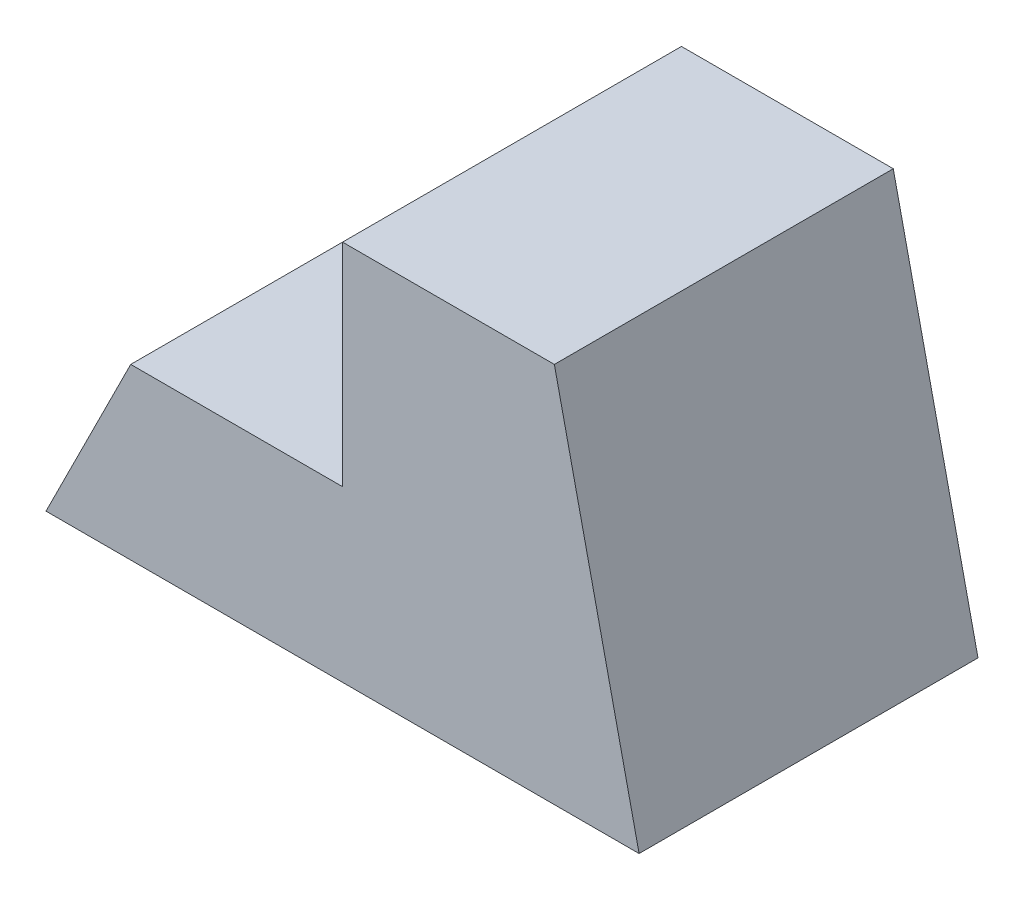
ISO-10303-21;
HEADER;
FILE_DESCRIPTION(('STEP AP214'),'2;1');
FILE_NAME('part.step','',(''),(''),'','','');
FILE_SCHEMA(('AUTOMOTIVE_DESIGN { 1 0 10303 214 1 1 1 1 }'));
ENDSEC;
DATA;
#1=APPLICATION_CONTEXT('core data for automotive mechanical design processes');
#2=APPLICATION_PROTOCOL_DEFINITION('international standard','automotive_design',2000,#1);
#3=PRODUCT_CONTEXT('',#1,'mechanical');
#4=PRODUCT('Part','Part','',(#3));
#5=PRODUCT_RELATED_PRODUCT_CATEGORY('part','',(#4));
#6=PRODUCT_DEFINITION_FORMATION('','',#4);
#7=PRODUCT_DEFINITION_CONTEXT('part definition',#1,'design');
#8=PRODUCT_DEFINITION('design','',#6,#7);
#9=PRODUCT_DEFINITION_SHAPE('','',#8);
#10=(LENGTH_UNIT() NAMED_UNIT(*) SI_UNIT(.MILLI.,.METRE.));
#11=(NAMED_UNIT(*) PLANE_ANGLE_UNIT() SI_UNIT($,.RADIAN.));
#12=(NAMED_UNIT(*) SI_UNIT($,.STERADIAN.) SOLID_ANGLE_UNIT());
#13=UNCERTAINTY_MEASURE_WITH_UNIT(LENGTH_MEASURE(1.E-05),#10,'distance_accuracy_value','');
#14=(GEOMETRIC_REPRESENTATION_CONTEXT(3) GLOBAL_UNCERTAINTY_ASSIGNED_CONTEXT((#13)) GLOBAL_UNIT_ASSIGNED_CONTEXT((#10,
#11,#12)) REPRESENTATION_CONTEXT('',''));
#15=CARTESIAN_POINT('',(0.,0.,0.));
#16=DIRECTION('',(0.,0.,1.));
#17=DIRECTION('',(1.,0.,0.));
#18=AXIS2_PLACEMENT_3D('',#15,#16,#17);
#19=CARTESIAN_POINT('',(10.,20.,40.));
#20=DIRECTION('',(0.894427190999916,-0.447213595499958,0.));
#21=DIRECTION('',(0.447213595499958,0.894427190999916,0.));
#22=AXIS2_PLACEMENT_3D('',#19,#20,#21);
#23=PLANE('',#22);
#24=DIRECTION('',(-0.447213595499958,-0.894427190999916,0.));
#25=VECTOR('',#24,1.);
#26=CARTESIAN_POINT('',(10.,20.,0.));
#27=LINE('',#26,#25);
#28=CARTESIAN_POINT('',(10.,20.,0.));
#29=VERTEX_POINT('',#28);
#30=CARTESIAN_POINT('',(0.,0.,0.));
#31=VERTEX_POINT('',#30);
#32=EDGE_CURVE('E131',#29,#31,#27,.T.);
#33=ORIENTED_EDGE('',*,*,#32,.T.);
#34=DIRECTION('',(0.,0.,-1.));
#35=VECTOR('',#34,1.);
#36=CARTESIAN_POINT('',(0.,0.,40.));
#37=LINE('',#36,#35);
#38=CARTESIAN_POINT('',(0.,0.,40.));
#39=VERTEX_POINT('',#38);
#40=EDGE_CURVE('E11',#39,#31,#37,.T.);
#41=ORIENTED_EDGE('',*,*,#40,.F.);
#42=DIRECTION('',(-0.447213595499958,-0.894427190999916,0.));
#43=VECTOR('',#42,1.);
#44=CARTESIAN_POINT('',(10.,20.,40.));
#45=LINE('',#44,#43);
#46=CARTESIAN_POINT('',(10.,20.,40.));
#47=VERTEX_POINT('',#46);
#48=EDGE_CURVE('E147',#47,#39,#45,.T.);
#49=ORIENTED_EDGE('',*,*,#48,.F.);
#50=DIRECTION('',(0.,0.,-1.));
#51=VECTOR('',#50,1.);
#52=CARTESIAN_POINT('',(10.,20.,40.));
#53=LINE('',#52,#51);
#54=EDGE_CURVE('E127',#47,#29,#53,.T.);
#55=ORIENTED_EDGE('',*,*,#54,.T.);
#56=EDGE_LOOP('',(#33,#41,#49,#55));
#57=FACE_BOUND('',#56,.T.);
#58=ADVANCED_FACE('F41',(#57),#23,.F.);
#59=CARTESIAN_POINT('',(0.,0.,40.));
#60=DIRECTION('',(0.,1.,0.));
#61=DIRECTION('',(0.,0.,1.));
#62=AXIS2_PLACEMENT_3D('',#59,#60,#61);
#63=PLANE('',#62);
#64=DIRECTION('',(1.,0.,0.));
#65=VECTOR('',#64,1.);
#66=CARTESIAN_POINT('',(0.,0.,0.));
#67=LINE('',#66,#65);
#68=CARTESIAN_POINT('',(70.,0.,0.));
#69=VERTEX_POINT('',#68);
#70=EDGE_CURVE('E135',#31,#69,#67,.T.);
#71=ORIENTED_EDGE('',*,*,#70,.T.);
#72=DIRECTION('',(0.,0.,-1.));
#73=VECTOR('',#72,1.);
#74=CARTESIAN_POINT('',(70.,0.,40.));
#75=LINE('',#74,#73);
#76=CARTESIAN_POINT('',(70.,0.,40.));
#77=VERTEX_POINT('',#76);
#78=EDGE_CURVE('E50',#77,#69,#75,.T.);
#79=ORIENTED_EDGE('',*,*,#78,.F.);
#80=DIRECTION('',(1.,0.,0.));
#81=VECTOR('',#80,1.);
#82=CARTESIAN_POINT('',(0.,0.,40.));
#83=LINE('',#82,#81);
#84=EDGE_CURVE('E95',#39,#77,#83,.T.);
#85=ORIENTED_EDGE('',*,*,#84,.F.);
#86=ORIENTED_EDGE('',*,*,#40,.T.);
#87=EDGE_LOOP('',(#71,#79,#85,#86));
#88=FACE_BOUND('',#87,.T.);
#89=ADVANCED_FACE('F176',(#88),#63,.F.);
#90=CARTESIAN_POINT('',(70.,0.,40.));
#91=DIRECTION('',(-0.976187060183953,-0.216930457818656,0.));
#92=DIRECTION('',(0.216930457818656,-0.976187060183953,0.));
#93=AXIS2_PLACEMENT_3D('',#90,#91,#92);
#94=PLANE('',#93);
#95=DIRECTION('',(-0.216930457818656,0.976187060183953,0.));
#96=VECTOR('',#95,1.);
#97=CARTESIAN_POINT('',(70.,0.,0.));
#98=LINE('',#97,#96);
#99=CARTESIAN_POINT('',(60.,45.,0.));
#100=VERTEX_POINT('',#99);
#101=EDGE_CURVE('E138',#69,#100,#98,.T.);
#102=ORIENTED_EDGE('',*,*,#101,.T.);
#103=DIRECTION('',(0.,0.,-1.));
#104=VECTOR('',#103,1.);
#105=CARTESIAN_POINT('',(60.,45.,40.));
#106=LINE('',#105,#104);
#107=CARTESIAN_POINT('',(60.,45.,40.));
#108=VERTEX_POINT('',#107);
#109=EDGE_CURVE('E119',#108,#100,#106,.T.);
#110=ORIENTED_EDGE('',*,*,#109,.F.);
#111=DIRECTION('',(-0.216930457818656,0.976187060183953,0.));
#112=VECTOR('',#111,1.);
#113=CARTESIAN_POINT('',(70.,0.,40.));
#114=LINE('',#113,#112);
#115=EDGE_CURVE('E108',#77,#108,#114,.T.);
#116=ORIENTED_EDGE('',*,*,#115,.F.);
#117=ORIENTED_EDGE('',*,*,#78,.T.);
#118=EDGE_LOOP('',(#102,#110,#116,#117));
#119=FACE_BOUND('',#118,.T.);
#120=ADVANCED_FACE('F158',(#119),#94,.F.);
#121=CARTESIAN_POINT('',(60.,45.,40.));
#122=DIRECTION('',(0.,-1.,0.));
#123=DIRECTION('',(0.,0.,-1.));
#124=AXIS2_PLACEMENT_3D('',#121,#122,#123);
#125=PLANE('',#124);
#126=DIRECTION('',(-1.,0.,0.));
#127=VECTOR('',#126,1.);
#128=CARTESIAN_POINT('',(60.,45.,0.));
#129=LINE('',#128,#127);
#130=CARTESIAN_POINT('',(35.,45.,0.));
#131=VERTEX_POINT('',#130);
#132=EDGE_CURVE('E117',#100,#131,#129,.T.);
#133=ORIENTED_EDGE('',*,*,#132,.T.);
#134=DIRECTION('',(0.,0.,-1.));
#135=VECTOR('',#134,1.);
#136=CARTESIAN_POINT('',(35.,45.,40.));
#137=LINE('',#136,#135);
#138=CARTESIAN_POINT('',(35.,45.,40.));
#139=VERTEX_POINT('',#138);
#140=EDGE_CURVE('E114',#139,#131,#137,.T.);
#141=ORIENTED_EDGE('',*,*,#140,.F.);
#142=DIRECTION('',(-1.,0.,0.));
#143=VECTOR('',#142,1.);
#144=CARTESIAN_POINT('',(60.,45.,40.));
#145=LINE('',#144,#143);
#146=EDGE_CURVE('E102',#108,#139,#145,.T.);
#147=ORIENTED_EDGE('',*,*,#146,.F.);
#148=ORIENTED_EDGE('',*,*,#109,.T.);
#149=EDGE_LOOP('',(#133,#141,#147,#148));
#150=FACE_BOUND('',#149,.T.);
#151=ADVANCED_FACE('F115',(#150),#125,.F.);
#152=CARTESIAN_POINT('',(35.,45.,40.));
#153=DIRECTION('',(1.,0.,0.));
#154=DIRECTION('',(0.,1.,0.));
#155=AXIS2_PLACEMENT_3D('',#152,#153,#154);
#156=PLANE('',#155);
#157=DIRECTION('',(0.,-1.,0.));
#158=VECTOR('',#157,1.);
#159=CARTESIAN_POINT('',(35.,45.,0.));
#160=LINE('',#159,#158);
#161=CARTESIAN_POINT('',(35.,20.,0.));
#162=VERTEX_POINT('',#161);
#163=EDGE_CURVE('E81',#131,#162,#160,.T.);
#164=ORIENTED_EDGE('',*,*,#163,.T.);
#165=DIRECTION('',(0.,0.,-1.));
#166=VECTOR('',#165,1.);
#167=CARTESIAN_POINT('',(35.,20.,40.));
#168=LINE('',#167,#166);
#169=CARTESIAN_POINT('',(35.,20.,40.));
#170=VERTEX_POINT('',#169);
#171=EDGE_CURVE('E120',#170,#162,#168,.T.);
#172=ORIENTED_EDGE('',*,*,#171,.F.);
#173=DIRECTION('',(0.,-1.,0.));
#174=VECTOR('',#173,1.);
#175=CARTESIAN_POINT('',(35.,45.,40.));
#176=LINE('',#175,#174);
#177=EDGE_CURVE('E106',#139,#170,#176,.T.);
#178=ORIENTED_EDGE('',*,*,#177,.F.);
#179=ORIENTED_EDGE('',*,*,#140,.T.);
#180=EDGE_LOOP('',(#164,#172,#178,#179));
#181=FACE_BOUND('',#180,.T.);
#182=ADVANCED_FACE('F122',(#181),#156,.F.);
#183=CARTESIAN_POINT('',(35.,20.,40.));
#184=DIRECTION('',(0.,-1.,0.));
#185=DIRECTION('',(1.,0.,0.));
#186=AXIS2_PLACEMENT_3D('',#183,#184,#185);
#187=PLANE('',#186);
#188=DIRECTION('',(-1.,0.,0.));
#189=VECTOR('',#188,1.);
#190=CARTESIAN_POINT('',(35.,20.,0.));
#191=LINE('',#190,#189);
#192=EDGE_CURVE('E87',#162,#29,#191,.T.);
#193=ORIENTED_EDGE('',*,*,#192,.T.);
#194=ORIENTED_EDGE('',*,*,#54,.F.);
#195=DIRECTION('',(-1.,0.,0.));
#196=VECTOR('',#195,1.);
#197=CARTESIAN_POINT('',(35.,20.,40.));
#198=LINE('',#197,#196);
#199=EDGE_CURVE('E58',#170,#47,#198,.T.);
#200=ORIENTED_EDGE('',*,*,#199,.F.);
#201=ORIENTED_EDGE('',*,*,#171,.T.);
#202=EDGE_LOOP('',(#193,#194,#200,#201));
#203=FACE_BOUND('',#202,.T.);
#204=ADVANCED_FACE('F165',(#203),#187,.F.);
#205=CARTESIAN_POINT('',(0.,0.,40.));
#206=DIRECTION('',(0.,0.,1.));
#207=DIRECTION('',(1.,0.,0.));
#208=AXIS2_PLACEMENT_3D('',#205,#206,#207);
#209=PLANE('',#208);
#210=ORIENTED_EDGE('',*,*,#48,.T.);
#211=ORIENTED_EDGE('',*,*,#84,.T.);
#212=ORIENTED_EDGE('',*,*,#115,.T.);
#213=ORIENTED_EDGE('',*,*,#146,.T.);
#214=ORIENTED_EDGE('',*,*,#177,.T.);
#215=ORIENTED_EDGE('',*,*,#199,.T.);
#216=EDGE_LOOP('',(#210,#211,#212,#213,#214,#215));
#217=FACE_BOUND('',#216,.T.);
#218=ADVANCED_FACE('F104',(#217),#209,.T.);
#219=CARTESIAN_POINT('',(0.,0.,0.));
#220=DIRECTION('',(0.,0.,1.));
#221=DIRECTION('',(1.,0.,0.));
#222=AXIS2_PLACEMENT_3D('',#219,#220,#221);
#223=PLANE('',#222);
#224=ORIENTED_EDGE('',*,*,#32,.F.);
#225=ORIENTED_EDGE('',*,*,#192,.F.);
#226=ORIENTED_EDGE('',*,*,#163,.F.);
#227=ORIENTED_EDGE('',*,*,#132,.F.);
#228=ORIENTED_EDGE('',*,*,#101,.F.);
#229=ORIENTED_EDGE('',*,*,#70,.F.);
#230=EDGE_LOOP('',(#224,#225,#226,#227,#228,#229));
#231=FACE_BOUND('',#230,.T.);
#232=ADVANCED_FACE('F161',(#231),#223,.F.);
#233=CLOSED_SHELL('',(#58,#89,#120,#151,#182,#204,#218,#232));
#234=MANIFOLD_SOLID_BREP('B2',#233);
#235=ADVANCED_BREP_SHAPE_REPRESENTATION('',(#18,#234),#14);
#236=SHAPE_DEFINITION_REPRESENTATION(#9,#235);
ENDSEC;
END-ISO-10303-21;
